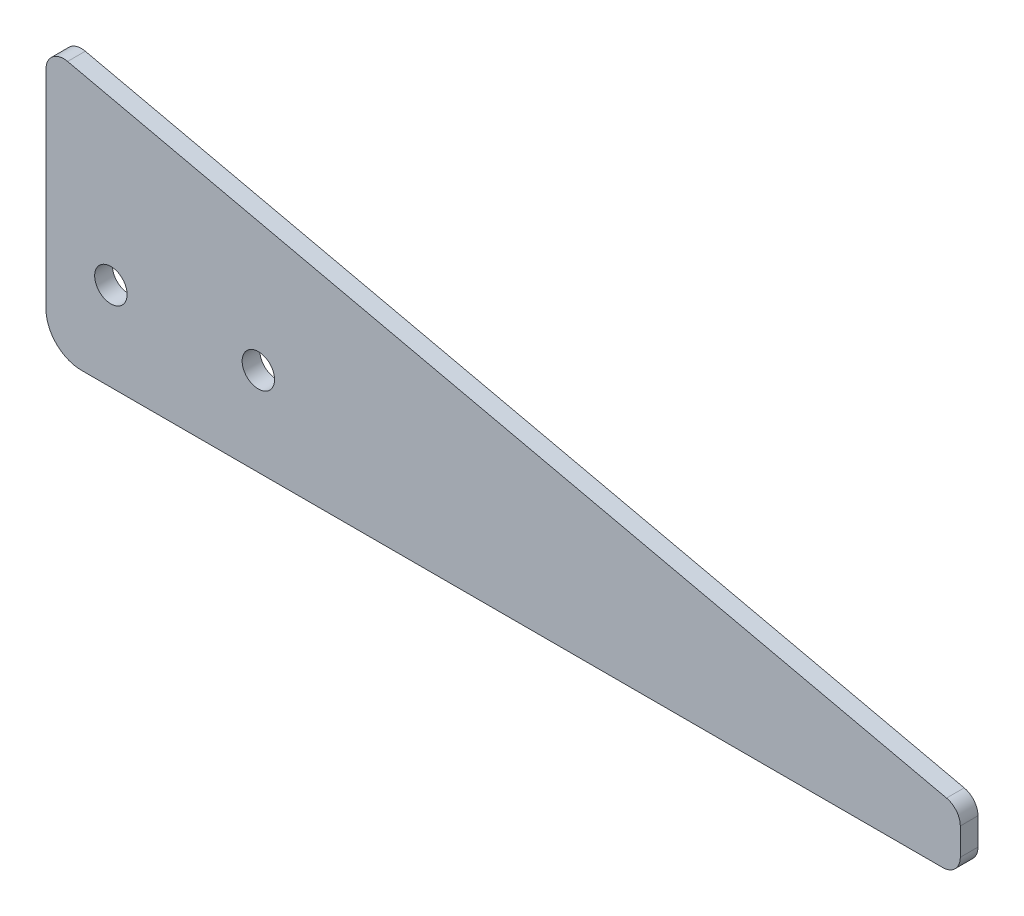
ISO-10303-21;
HEADER;
FILE_DESCRIPTION(('STEP AP214'),'2;1');
FILE_NAME('part.step','',(''),(''),'','','');
FILE_SCHEMA(('AUTOMOTIVE_DESIGN { 1 0 10303 214 1 1 1 1 }'));
ENDSEC;
DATA;
#1=APPLICATION_CONTEXT('core data for automotive mechanical design processes');
#2=APPLICATION_PROTOCOL_DEFINITION('international standard','automotive_design',2000,#1);
#3=PRODUCT_CONTEXT('',#1,'mechanical');
#4=PRODUCT('Part','Part','',(#3));
#5=PRODUCT_RELATED_PRODUCT_CATEGORY('part','',(#4));
#6=PRODUCT_DEFINITION_FORMATION('','',#4);
#7=PRODUCT_DEFINITION_CONTEXT('part definition',#1,'design');
#8=PRODUCT_DEFINITION('design','',#6,#7);
#9=PRODUCT_DEFINITION_SHAPE('','',#8);
#10=(LENGTH_UNIT() NAMED_UNIT(*) SI_UNIT(.MILLI.,.METRE.));
#11=(NAMED_UNIT(*) PLANE_ANGLE_UNIT() SI_UNIT($,.RADIAN.));
#12=(NAMED_UNIT(*) SI_UNIT($,.STERADIAN.) SOLID_ANGLE_UNIT());
#13=UNCERTAINTY_MEASURE_WITH_UNIT(LENGTH_MEASURE(1.E-05),#10,'distance_accuracy_value','');
#14=(GEOMETRIC_REPRESENTATION_CONTEXT(3) GLOBAL_UNCERTAINTY_ASSIGNED_CONTEXT((#13)) GLOBAL_UNIT_ASSIGNED_CONTEXT((#10,
#11,#12)) REPRESENTATION_CONTEXT('',''));
#15=CARTESIAN_POINT('',(0.,0.,0.));
#16=DIRECTION('',(0.,0.,1.));
#17=DIRECTION('',(1.,0.,0.));
#18=AXIS2_PLACEMENT_3D('',#15,#16,#17);
#19=CARTESIAN_POINT('',(6.,6.,-3.));
#20=DIRECTION('',(0.,0.,1.));
#21=DIRECTION('',(1.,0.,0.));
#22=AXIS2_PLACEMENT_3D('',#19,#20,#21);
#23=CYLINDRICAL_SURFACE('',#22,6.);
#24=CARTESIAN_POINT('',(6.,6.,0.));
#25=DIRECTION('',(0.,0.,1.));
#26=DIRECTION('',(1.,0.,0.));
#27=AXIS2_PLACEMENT_3D('',#24,#25,#26);
#28=CIRCLE('',#27,6.);
#29=CARTESIAN_POINT('',(0.,6.,0.));
#30=VERTEX_POINT('',#29);
#31=CARTESIAN_POINT('',(6.,0.,0.));
#32=VERTEX_POINT('',#31);
#33=EDGE_CURVE('E138',#30,#32,#28,.T.);
#34=ORIENTED_EDGE('',*,*,#33,.F.);
#35=DIRECTION('',(0.,0.,1.));
#36=VECTOR('',#35,1.);
#37=CARTESIAN_POINT('',(0.,6.,-3.));
#38=LINE('',#37,#36);
#39=CARTESIAN_POINT('',(0.,6.,-3.));
#40=VERTEX_POINT('',#39);
#41=EDGE_CURVE('E11',#40,#30,#38,.T.);
#42=ORIENTED_EDGE('',*,*,#41,.F.);
#43=CARTESIAN_POINT('',(6.,6.,-3.));
#44=DIRECTION('',(0.,0.,1.));
#45=DIRECTION('',(1.,0.,0.));
#46=AXIS2_PLACEMENT_3D('',#43,#44,#45);
#47=CIRCLE('',#46,6.);
#48=CARTESIAN_POINT('',(6.,0.,-3.));
#49=VERTEX_POINT('',#48);
#50=EDGE_CURVE('E158',#40,#49,#47,.T.);
#51=ORIENTED_EDGE('',*,*,#50,.T.);
#52=DIRECTION('',(0.,0.,1.));
#53=VECTOR('',#52,1.);
#54=CARTESIAN_POINT('',(6.,0.,-3.));
#55=LINE('',#54,#53);
#56=EDGE_CURVE('E96',#49,#32,#55,.T.);
#57=ORIENTED_EDGE('',*,*,#56,.T.);
#58=EDGE_LOOP('',(#34,#42,#51,#57));
#59=FACE_BOUND('',#58,.T.);
#60=ADVANCED_FACE('F40',(#59),#23,.T.);
#61=CARTESIAN_POINT('',(0.,41.2470486615347,-3.));
#62=DIRECTION('',(-1.,0.,0.));
#63=DIRECTION('',(0.,-1.,0.));
#64=AXIS2_PLACEMENT_3D('',#61,#62,#63);
#65=PLANE('',#64);
#66=DIRECTION('',(0.,-1.,0.));
#67=VECTOR('',#66,1.);
#68=CARTESIAN_POINT('',(0.,41.2470486615347,0.));
#69=LINE('',#68,#67);
#70=CARTESIAN_POINT('',(0.,41.2470486615347,0.));
#71=VERTEX_POINT('',#70);
#72=EDGE_CURVE('E156',#71,#30,#69,.T.);
#73=ORIENTED_EDGE('',*,*,#72,.F.);
#74=DIRECTION('',(0.,0.,1.));
#75=VECTOR('',#74,1.);
#76=CARTESIAN_POINT('',(0.,41.2470486615347,-3.));
#77=LINE('',#76,#75);
#78=CARTESIAN_POINT('',(0.,41.2470486615347,-3.));
#79=VERTEX_POINT('',#78);
#80=EDGE_CURVE('E49',#79,#71,#77,.T.);
#81=ORIENTED_EDGE('',*,*,#80,.F.);
#82=DIRECTION('',(0.,-1.,0.));
#83=VECTOR('',#82,1.);
#84=CARTESIAN_POINT('',(0.,41.2470486615347,-3.));
#85=LINE('',#84,#83);
#86=EDGE_CURVE('E128',#79,#40,#85,.T.);
#87=ORIENTED_EDGE('',*,*,#86,.T.);
#88=ORIENTED_EDGE('',*,*,#41,.T.);
#89=EDGE_LOOP('',(#73,#81,#87,#88));
#90=FACE_BOUND('',#89,.T.);
#91=ADVANCED_FACE('F200',(#90),#65,.T.);
#92=CARTESIAN_POINT('',(3.,41.2470486615347,-3.));
#93=DIRECTION('',(0.,0.,1.));
#94=DIRECTION('',(1.,0.,0.));
#95=AXIS2_PLACEMENT_3D('',#92,#93,#94);
#96=CYLINDRICAL_SURFACE('',#95,3.);
#97=CARTESIAN_POINT('',(3.,41.2470486615347,0.));
#98=DIRECTION('',(0.,0.,1.));
#99=DIRECTION('',(1.,0.,0.));
#100=AXIS2_PLACEMENT_3D('',#97,#98,#99);
#101=CIRCLE('',#100,3.);
#102=CARTESIAN_POINT('',(3.66078261430393,44.1733716677378,0.));
#103=VERTEX_POINT('',#102);
#104=EDGE_CURVE('E115',#103,#71,#101,.T.);
#105=ORIENTED_EDGE('',*,*,#104,.F.);
#106=DIRECTION('',(0.,0.,1.));
#107=VECTOR('',#106,1.);
#108=CARTESIAN_POINT('',(3.66078261430393,44.1733716677378,-3.));
#109=LINE('',#108,#107);
#110=CARTESIAN_POINT('',(3.66078261430393,44.1733716677378,-3.));
#111=VERTEX_POINT('',#110);
#112=EDGE_CURVE('E110',#111,#103,#109,.T.);
#113=ORIENTED_EDGE('',*,*,#112,.F.);
#114=CARTESIAN_POINT('',(3.,41.2470486615347,-3.));
#115=DIRECTION('',(0.,0.,1.));
#116=DIRECTION('',(1.,0.,0.));
#117=AXIS2_PLACEMENT_3D('',#114,#115,#116);
#118=CIRCLE('',#117,3.);
#119=EDGE_CURVE('E113',#111,#79,#118,.T.);
#120=ORIENTED_EDGE('',*,*,#119,.T.);
#121=ORIENTED_EDGE('',*,*,#80,.T.);
#122=EDGE_LOOP('',(#105,#113,#120,#121));
#123=FACE_BOUND('',#122,.T.);
#124=ADVANCED_FACE('F112',(#123),#96,.T.);
#125=CARTESIAN_POINT('',(152.660782614304,10.5282103774152,-3.));
#126=DIRECTION('',(0.220260871434643,0.975441002067706,0.));
#127=DIRECTION('',(-0.975441002067707,0.220260871434643,0.));
#128=AXIS2_PLACEMENT_3D('',#125,#126,#127);
#129=PLANE('',#128);
#130=DIRECTION('',(-0.975441002067707,0.220260871434643,0.));
#131=VECTOR('',#130,1.);
#132=CARTESIAN_POINT('',(152.660782614304,10.5282103774152,0.));
#133=LINE('',#132,#131);
#134=CARTESIAN_POINT('',(152.660782614304,10.5282103774152,0.));
#135=VERTEX_POINT('',#134);
#136=EDGE_CURVE('E153',#135,#103,#133,.T.);
#137=ORIENTED_EDGE('',*,*,#136,.F.);
#138=DIRECTION('',(0.,0.,1.));
#139=VECTOR('',#138,1.);
#140=CARTESIAN_POINT('',(152.660782614304,10.5282103774152,-3.));
#141=LINE('',#140,#139);
#142=CARTESIAN_POINT('',(152.660782614304,10.5282103774152,-3.));
#143=VERTEX_POINT('',#142);
#144=EDGE_CURVE('E120',#143,#135,#141,.T.);
#145=ORIENTED_EDGE('',*,*,#144,.F.);
#146=DIRECTION('',(-0.975441002067707,0.220260871434643,0.));
#147=VECTOR('',#146,1.);
#148=CARTESIAN_POINT('',(152.660782614304,10.5282103774152,-3.));
#149=LINE('',#148,#147);
#150=EDGE_CURVE('E126',#143,#111,#149,.T.);
#151=ORIENTED_EDGE('',*,*,#150,.T.);
#152=ORIENTED_EDGE('',*,*,#112,.T.);
#153=EDGE_LOOP('',(#137,#145,#151,#152));
#154=FACE_BOUND('',#153,.T.);
#155=ADVANCED_FACE('F130',(#154),#129,.T.);
#156=CARTESIAN_POINT('',(152.,7.60188737121212,-3.));
#157=DIRECTION('',(0.,0.,1.));
#158=DIRECTION('',(1.,0.,0.));
#159=AXIS2_PLACEMENT_3D('',#156,#157,#158);
#160=CYLINDRICAL_SURFACE('',#159,2.99999999999999);
#161=CARTESIAN_POINT('',(152.,7.60188737121212,0.));
#162=DIRECTION('',(0.,0.,1.));
#163=DIRECTION('',(1.,0.,0.));
#164=AXIS2_PLACEMENT_3D('',#161,#162,#163);
#165=CIRCLE('',#164,2.99999999999999);
#166=CARTESIAN_POINT('',(155.,7.60188737121212,0.));
#167=VERTEX_POINT('',#166);
#168=EDGE_CURVE('E150',#167,#135,#165,.T.);
#169=ORIENTED_EDGE('',*,*,#168,.F.);
#170=DIRECTION('',(0.,0.,1.));
#171=VECTOR('',#170,1.);
#172=CARTESIAN_POINT('',(155.,7.60188737121212,-3.));
#173=LINE('',#172,#171);
#174=CARTESIAN_POINT('',(155.,7.60188737121212,-3.));
#175=VERTEX_POINT('',#174);
#176=EDGE_CURVE('E162',#175,#167,#173,.T.);
#177=ORIENTED_EDGE('',*,*,#176,.F.);
#178=CARTESIAN_POINT('',(152.,7.60188737121212,-3.));
#179=DIRECTION('',(0.,0.,1.));
#180=DIRECTION('',(1.,0.,0.));
#181=AXIS2_PLACEMENT_3D('',#178,#179,#180);
#182=CIRCLE('',#181,2.99999999999999);
#183=EDGE_CURVE('E131',#175,#143,#182,.T.);
#184=ORIENTED_EDGE('',*,*,#183,.T.);
#185=ORIENTED_EDGE('',*,*,#144,.T.);
#186=EDGE_LOOP('',(#169,#177,#184,#185));
#187=FACE_BOUND('',#186,.T.);
#188=ADVANCED_FACE('F213',(#187),#160,.T.);
#189=CARTESIAN_POINT('',(155.,3.,-3.));
#190=DIRECTION('',(1.,0.,0.));
#191=DIRECTION('',(0.,1.,0.));
#192=AXIS2_PLACEMENT_3D('',#189,#190,#191);
#193=PLANE('',#192);
#194=DIRECTION('',(0.,1.,0.));
#195=VECTOR('',#194,1.);
#196=CARTESIAN_POINT('',(155.,3.,0.));
#197=LINE('',#196,#195);
#198=CARTESIAN_POINT('',(155.,3.,0.));
#199=VERTEX_POINT('',#198);
#200=EDGE_CURVE('E147',#199,#167,#197,.T.);
#201=ORIENTED_EDGE('',*,*,#200,.F.);
#202=DIRECTION('',(0.,0.,1.));
#203=VECTOR('',#202,1.);
#204=CARTESIAN_POINT('',(155.,3.,-3.));
#205=LINE('',#204,#203);
#206=CARTESIAN_POINT('',(155.,3.,-3.));
#207=VERTEX_POINT('',#206);
#208=EDGE_CURVE('E164',#207,#199,#205,.T.);
#209=ORIENTED_EDGE('',*,*,#208,.F.);
#210=DIRECTION('',(0.,1.,0.));
#211=VECTOR('',#210,1.);
#212=CARTESIAN_POINT('',(155.,3.,-3.));
#213=LINE('',#212,#211);
#214=EDGE_CURVE('E133',#207,#175,#213,.T.);
#215=ORIENTED_EDGE('',*,*,#214,.T.);
#216=ORIENTED_EDGE('',*,*,#176,.T.);
#217=EDGE_LOOP('',(#201,#209,#215,#216));
#218=FACE_BOUND('',#217,.T.);
#219=ADVANCED_FACE('F191',(#218),#193,.T.);
#220=CARTESIAN_POINT('',(152.,3.,-3.));
#221=DIRECTION('',(0.,0.,1.));
#222=DIRECTION('',(1.,0.,0.));
#223=AXIS2_PLACEMENT_3D('',#220,#221,#222);
#224=CYLINDRICAL_SURFACE('',#223,3.);
#225=CARTESIAN_POINT('',(152.,3.,0.));
#226=DIRECTION('',(0.,0.,1.));
#227=DIRECTION('',(1.,0.,0.));
#228=AXIS2_PLACEMENT_3D('',#225,#226,#227);
#229=CIRCLE('',#228,3.);
#230=CARTESIAN_POINT('',(152.,0.,0.));
#231=VERTEX_POINT('',#230);
#232=EDGE_CURVE('E144',#231,#199,#229,.T.);
#233=ORIENTED_EDGE('',*,*,#232,.F.);
#234=DIRECTION('',(0.,0.,1.));
#235=VECTOR('',#234,1.);
#236=CARTESIAN_POINT('',(152.,0.,-3.));
#237=LINE('',#236,#235);
#238=CARTESIAN_POINT('',(152.,0.,-3.));
#239=VERTEX_POINT('',#238);
#240=EDGE_CURVE('E166',#239,#231,#237,.T.);
#241=ORIENTED_EDGE('',*,*,#240,.F.);
#242=CARTESIAN_POINT('',(152.,3.,-3.));
#243=DIRECTION('',(0.,0.,1.));
#244=DIRECTION('',(1.,0.,0.));
#245=AXIS2_PLACEMENT_3D('',#242,#243,#244);
#246=CIRCLE('',#245,3.);
#247=EDGE_CURVE('E185',#239,#207,#246,.T.);
#248=ORIENTED_EDGE('',*,*,#247,.T.);
#249=ORIENTED_EDGE('',*,*,#208,.T.);
#250=EDGE_LOOP('',(#233,#241,#248,#249));
#251=FACE_BOUND('',#250,.T.);
#252=ADVANCED_FACE('F196',(#251),#224,.T.);
#253=CARTESIAN_POINT('',(6.,0.,-3.));
#254=DIRECTION('',(0.,-1.,0.));
#255=DIRECTION('',(0.,0.,-1.));
#256=AXIS2_PLACEMENT_3D('',#253,#254,#255);
#257=PLANE('',#256);
#258=DIRECTION('',(1.,0.,0.));
#259=VECTOR('',#258,1.);
#260=CARTESIAN_POINT('',(6.,0.,0.));
#261=LINE('',#260,#259);
#262=EDGE_CURVE('E141',#32,#231,#261,.T.);
#263=ORIENTED_EDGE('',*,*,#262,.F.);
#264=ORIENTED_EDGE('',*,*,#56,.F.);
#265=DIRECTION('',(1.,0.,0.));
#266=VECTOR('',#265,1.);
#267=CARTESIAN_POINT('',(6.,0.,-3.));
#268=LINE('',#267,#266);
#269=EDGE_CURVE('E183',#49,#239,#268,.T.);
#270=ORIENTED_EDGE('',*,*,#269,.T.);
#271=ORIENTED_EDGE('',*,*,#240,.T.);
#272=EDGE_LOOP('',(#263,#264,#270,#271));
#273=FACE_BOUND('',#272,.T.);
#274=ADVANCED_FACE('F197',(#273),#257,.T.);
#275=CARTESIAN_POINT('',(6.,6.,-3.));
#276=DIRECTION('',(0.,0.,1.));
#277=DIRECTION('',(1.,0.,0.));
#278=AXIS2_PLACEMENT_3D('',#275,#276,#277);
#279=PLANE('',#278);
#280=CARTESIAN_POINT('',(11.,15.,-3.));
#281=DIRECTION('',(0.,0.,-1.));
#282=DIRECTION('',(-1.,0.,0.));
#283=AXIS2_PLACEMENT_3D('',#280,#281,#282);
#284=CIRCLE('',#283,2.75);
#285=CARTESIAN_POINT('',(8.25,15.,-3.));
#286=VERTEX_POINT('',#285);
#287=EDGE_CURVE('E170',#286,#286,#284,.T.);
#288=ORIENTED_EDGE('',*,*,#287,.F.);
#289=EDGE_LOOP('',(#288));
#290=FACE_BOUND('',#289,.T.);
#291=CARTESIAN_POINT('',(36.,15.,-3.));
#292=DIRECTION('',(0.,0.,-1.));
#293=DIRECTION('',(-1.,0.,0.));
#294=AXIS2_PLACEMENT_3D('',#291,#292,#293);
#295=CIRCLE('',#294,2.75);
#296=CARTESIAN_POINT('',(33.25,15.,-3.));
#297=VERTEX_POINT('',#296);
#298=EDGE_CURVE('E175',#297,#297,#295,.T.);
#299=ORIENTED_EDGE('',*,*,#298,.F.);
#300=EDGE_LOOP('',(#299));
#301=FACE_BOUND('',#300,.T.);
#302=ORIENTED_EDGE('',*,*,#50,.F.);
#303=ORIENTED_EDGE('',*,*,#86,.F.);
#304=ORIENTED_EDGE('',*,*,#119,.F.);
#305=ORIENTED_EDGE('',*,*,#150,.F.);
#306=ORIENTED_EDGE('',*,*,#183,.F.);
#307=ORIENTED_EDGE('',*,*,#214,.F.);
#308=ORIENTED_EDGE('',*,*,#247,.F.);
#309=ORIENTED_EDGE('',*,*,#269,.F.);
#310=EDGE_LOOP('',(#302,#303,#304,#305,#306,#307,#308,#309));
#311=FACE_BOUND('',#310,.T.);
#312=ADVANCED_FACE('F124',(#290,#301,#311),#279,.F.);
#313=CARTESIAN_POINT('',(6.,6.,0.));
#314=DIRECTION('',(0.,0.,1.));
#315=DIRECTION('',(1.,0.,0.));
#316=AXIS2_PLACEMENT_3D('',#313,#314,#315);
#317=PLANE('',#316);
#318=CARTESIAN_POINT('',(11.,15.,0.));
#319=DIRECTION('',(0.,0.,1.));
#320=DIRECTION('',(1.,0.,0.));
#321=AXIS2_PLACEMENT_3D('',#318,#319,#320);
#322=CIRCLE('',#321,2.75);
#323=CARTESIAN_POINT('',(13.75,15.,0.));
#324=VERTEX_POINT('',#323);
#325=EDGE_CURVE('E43',#324,#324,#322,.T.);
#326=ORIENTED_EDGE('',*,*,#325,.F.);
#327=EDGE_LOOP('',(#326));
#328=FACE_BOUND('',#327,.T.);
#329=CARTESIAN_POINT('',(36.,15.,0.));
#330=DIRECTION('',(0.,0.,1.));
#331=DIRECTION('',(1.,0.,0.));
#332=AXIS2_PLACEMENT_3D('',#329,#330,#331);
#333=CIRCLE('',#332,2.75);
#334=CARTESIAN_POINT('',(38.75,15.,0.));
#335=VERTEX_POINT('',#334);
#336=EDGE_CURVE('E168',#335,#335,#333,.T.);
#337=ORIENTED_EDGE('',*,*,#336,.F.);
#338=EDGE_LOOP('',(#337));
#339=FACE_BOUND('',#338,.T.);
#340=ORIENTED_EDGE('',*,*,#33,.T.);
#341=ORIENTED_EDGE('',*,*,#262,.T.);
#342=ORIENTED_EDGE('',*,*,#232,.T.);
#343=ORIENTED_EDGE('',*,*,#200,.T.);
#344=ORIENTED_EDGE('',*,*,#168,.T.);
#345=ORIENTED_EDGE('',*,*,#136,.T.);
#346=ORIENTED_EDGE('',*,*,#104,.T.);
#347=ORIENTED_EDGE('',*,*,#72,.T.);
#348=EDGE_LOOP('',(#340,#341,#342,#343,#344,#345,#346,#347));
#349=FACE_BOUND('',#348,.T.);
#350=ADVANCED_FACE('F199',(#328,#339,#349),#317,.T.);
#351=CARTESIAN_POINT('',(36.,15.,7.));
#352=DIRECTION('',(0.,0.,-1.));
#353=DIRECTION('',(-1.,0.,0.));
#354=AXIS2_PLACEMENT_3D('',#351,#352,#353);
#355=CYLINDRICAL_SURFACE('',#354,2.75);
#356=ORIENTED_EDGE('',*,*,#336,.T.);
#357=EDGE_LOOP('',(#356));
#358=FACE_BOUND('',#357,.T.);
#359=ORIENTED_EDGE('',*,*,#298,.T.);
#360=EDGE_LOOP('',(#359));
#361=FACE_BOUND('',#360,.T.);
#362=ADVANCED_FACE('F228',(#358,#361),#355,.F.);
#363=CARTESIAN_POINT('',(11.,15.,7.));
#364=DIRECTION('',(0.,0.,-1.));
#365=DIRECTION('',(-1.,0.,0.));
#366=AXIS2_PLACEMENT_3D('',#363,#364,#365);
#367=CYLINDRICAL_SURFACE('',#366,2.75);
#368=ORIENTED_EDGE('',*,*,#325,.T.);
#369=EDGE_LOOP('',(#368));
#370=FACE_BOUND('',#369,.T.);
#371=ORIENTED_EDGE('',*,*,#287,.T.);
#372=EDGE_LOOP('',(#371));
#373=FACE_BOUND('',#372,.T.);
#374=ADVANCED_FACE('F234',(#370,#373),#367,.F.);
#375=CLOSED_SHELL('',(#60,#91,#124,#155,#188,#219,#252,#274,#312,#350,#362,#374));
#376=MANIFOLD_SOLID_BREP('B2',#375);
#377=ADVANCED_BREP_SHAPE_REPRESENTATION('',(#18,#376),#14);
#378=SHAPE_DEFINITION_REPRESENTATION(#9,#377);
ENDSEC;
END-ISO-10303-21;
